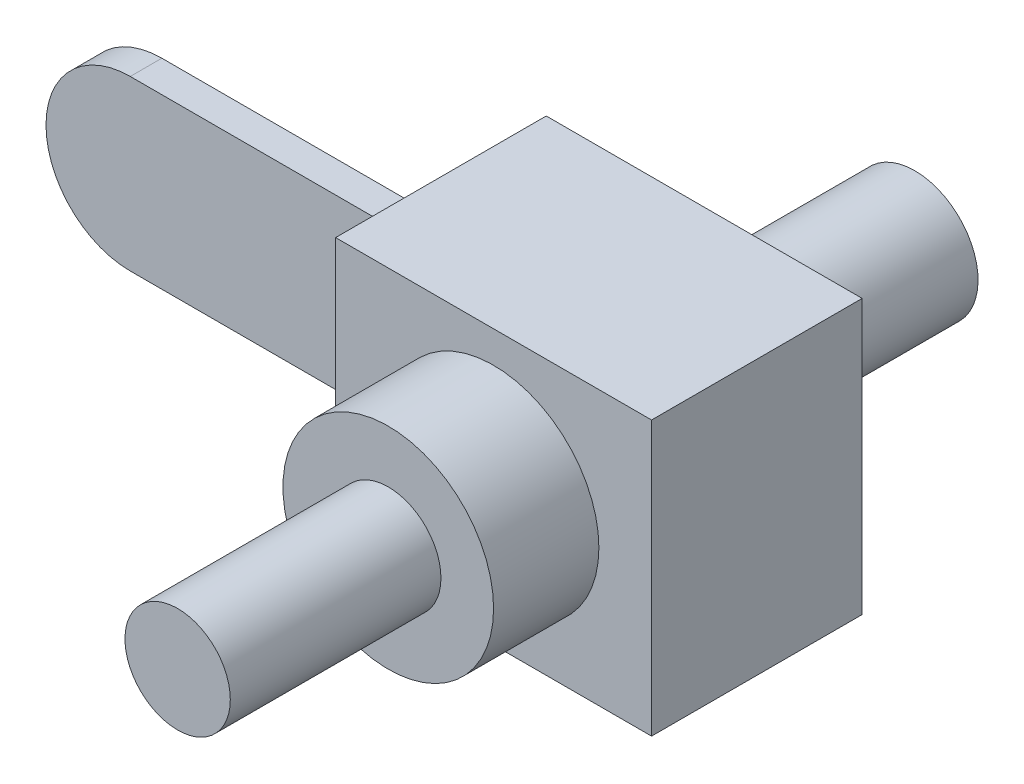
ISO-10303-21;
HEADER;
FILE_DESCRIPTION(('STEP AP214'),'2;1');
FILE_NAME('part.step','',(''),(''),'','','');
FILE_SCHEMA(('AUTOMOTIVE_DESIGN { 1 0 10303 214 1 1 1 1 }'));
ENDSEC;
DATA;
#1=APPLICATION_CONTEXT('core data for automotive mechanical design processes');
#2=APPLICATION_PROTOCOL_DEFINITION('international standard','automotive_design',2000,#1);
#3=PRODUCT_CONTEXT('',#1,'mechanical');
#4=PRODUCT('Part','Part','',(#3));
#5=PRODUCT_RELATED_PRODUCT_CATEGORY('part','',(#4));
#6=PRODUCT_DEFINITION_FORMATION('','',#4);
#7=PRODUCT_DEFINITION_CONTEXT('part definition',#1,'design');
#8=PRODUCT_DEFINITION('design','',#6,#7);
#9=PRODUCT_DEFINITION_SHAPE('','',#8);
#10=(LENGTH_UNIT() NAMED_UNIT(*) SI_UNIT(.MILLI.,.METRE.));
#11=(NAMED_UNIT(*) PLANE_ANGLE_UNIT() SI_UNIT($,.RADIAN.));
#12=(NAMED_UNIT(*) SI_UNIT($,.STERADIAN.) SOLID_ANGLE_UNIT());
#13=UNCERTAINTY_MEASURE_WITH_UNIT(LENGTH_MEASURE(1.E-05),#10,'distance_accuracy_value','');
#14=(GEOMETRIC_REPRESENTATION_CONTEXT(3) GLOBAL_UNCERTAINTY_ASSIGNED_CONTEXT((#13)) GLOBAL_UNIT_ASSIGNED_CONTEXT((#10,
#11,#12)) REPRESENTATION_CONTEXT('',''));
#15=CARTESIAN_POINT('',(0.,0.,0.));
#16=DIRECTION('',(0.,0.,1.));
#17=DIRECTION('',(1.,0.,0.));
#18=AXIS2_PLACEMENT_3D('',#15,#16,#17);
#19=CARTESIAN_POINT('',(0.,0.,7.5));
#20=DIRECTION('',(0.,0.,-1.));
#21=DIRECTION('',(-1.,0.,0.));
#22=AXIS2_PLACEMENT_3D('',#19,#20,#21);
#23=CYLINDRICAL_SURFACE('',#22,40.);
#24=CARTESIAN_POINT('',(0.,0.,-7.5));
#25=DIRECTION('',(0.,0.,1.));
#26=DIRECTION('',(1.,0.,0.));
#27=AXIS2_PLACEMENT_3D('',#24,#25,#26);
#28=CIRCLE('',#27,40.);
#29=CARTESIAN_POINT('',(0.,40.,-7.5));
#30=VERTEX_POINT('',#29);
#31=CARTESIAN_POINT('',(0.,-40.,-7.5));
#32=VERTEX_POINT('',#31);
#33=EDGE_CURVE('E141',#30,#32,#28,.T.);
#34=ORIENTED_EDGE('',*,*,#33,.T.);
#35=DIRECTION('',(0.,0.,-1.));
#36=VECTOR('',#35,1.);
#37=CARTESIAN_POINT('',(0.,-40.,7.5));
#38=LINE('',#37,#36);
#39=CARTESIAN_POINT('',(0.,-40.,7.5));
#40=VERTEX_POINT('',#39);
#41=EDGE_CURVE('E42',#40,#32,#38,.T.);
#42=ORIENTED_EDGE('',*,*,#41,.F.);
#43=CARTESIAN_POINT('',(0.,0.,7.5));
#44=DIRECTION('',(0.,0.,1.));
#45=DIRECTION('',(1.,0.,0.));
#46=AXIS2_PLACEMENT_3D('',#43,#44,#45);
#47=CIRCLE('',#46,40.);
#48=CARTESIAN_POINT('',(0.,40.,7.5));
#49=VERTEX_POINT('',#48);
#50=EDGE_CURVE('E152',#49,#40,#47,.T.);
#51=ORIENTED_EDGE('',*,*,#50,.F.);
#52=DIRECTION('',(0.,0.,-1.));
#53=VECTOR('',#52,1.);
#54=CARTESIAN_POINT('',(0.,40.,7.5));
#55=LINE('',#54,#53);
#56=EDGE_CURVE('E161',#49,#30,#55,.T.);
#57=ORIENTED_EDGE('',*,*,#56,.T.);
#58=EDGE_LOOP('',(#34,#42,#51,#57));
#59=FACE_BOUND('',#58,.T.);
#60=ADVANCED_FACE('F39',(#59),#23,.T.);
#61=CARTESIAN_POINT('',(140.,-40.,7.5));
#62=DIRECTION('',(0.,1.,0.));
#63=DIRECTION('',(-1.,0.,0.));
#64=AXIS2_PLACEMENT_3D('',#61,#62,#63);
#65=PLANE('',#64);
#66=DIRECTION('',(1.,0.,0.));
#67=VECTOR('',#66,1.);
#68=CARTESIAN_POINT('',(140.,-40.,-7.5));
#69=LINE('',#68,#67);
#70=CARTESIAN_POINT('',(140.,-40.,-7.5));
#71=VERTEX_POINT('',#70);
#72=EDGE_CURVE('E146',#32,#71,#69,.T.);
#73=ORIENTED_EDGE('',*,*,#72,.T.);
#74=DIRECTION('',(0.,0.,-1.));
#75=VECTOR('',#74,1.);
#76=CARTESIAN_POINT('',(140.,-40.,7.5));
#77=LINE('',#76,#75);
#78=CARTESIAN_POINT('',(140.,-40.,7.5));
#79=VERTEX_POINT('',#78);
#80=EDGE_CURVE('E175',#79,#71,#77,.T.);
#81=ORIENTED_EDGE('',*,*,#80,.F.);
#82=DIRECTION('',(1.,0.,0.));
#83=VECTOR('',#82,1.);
#84=CARTESIAN_POINT('',(140.,-40.,7.5));
#85=LINE('',#84,#83);
#86=EDGE_CURVE('E83',#40,#79,#85,.T.);
#87=ORIENTED_EDGE('',*,*,#86,.F.);
#88=ORIENTED_EDGE('',*,*,#41,.T.);
#89=EDGE_LOOP('',(#73,#81,#87,#88));
#90=FACE_BOUND('',#89,.T.);
#91=ADVANCED_FACE('F234',(#90),#65,.F.);
#92=CARTESIAN_POINT('',(0.,40.,7.5));
#93=DIRECTION('',(0.,-1.,0.));
#94=DIRECTION('',(1.,0.,0.));
#95=AXIS2_PLACEMENT_3D('',#92,#93,#94);
#96=PLANE('',#95);
#97=DIRECTION('',(-1.,0.,0.));
#98=VECTOR('',#97,1.);
#99=CARTESIAN_POINT('',(0.,40.,-7.5));
#100=LINE('',#99,#98);
#101=CARTESIAN_POINT('',(140.,40.,-7.5));
#102=VERTEX_POINT('',#101);
#103=EDGE_CURVE('E75',#102,#30,#100,.T.);
#104=ORIENTED_EDGE('',*,*,#103,.T.);
#105=ORIENTED_EDGE('',*,*,#56,.F.);
#106=DIRECTION('',(-1.,0.,0.));
#107=VECTOR('',#106,1.);
#108=CARTESIAN_POINT('',(0.,40.,7.5));
#109=LINE('',#108,#107);
#110=CARTESIAN_POINT('',(140.,40.,7.5));
#111=VERTEX_POINT('',#110);
#112=EDGE_CURVE('E58',#111,#49,#109,.T.);
#113=ORIENTED_EDGE('',*,*,#112,.F.);
#114=DIRECTION('',(0.,0.,-1.));
#115=VECTOR('',#114,1.);
#116=CARTESIAN_POINT('',(140.,40.,7.5));
#117=LINE('',#116,#115);
#118=EDGE_CURVE('E72',#111,#102,#117,.T.);
#119=ORIENTED_EDGE('',*,*,#118,.T.);
#120=EDGE_LOOP('',(#104,#105,#113,#119));
#121=FACE_BOUND('',#120,.T.);
#122=ADVANCED_FACE('F239',(#121),#96,.F.);
#123=CARTESIAN_POINT('',(0.,0.,7.5));
#124=DIRECTION('',(0.,0.,1.));
#125=DIRECTION('',(1.,0.,0.));
#126=AXIS2_PLACEMENT_3D('',#123,#124,#125);
#127=PLANE('',#126);
#128=ORIENTED_EDGE('',*,*,#50,.T.);
#129=ORIENTED_EDGE('',*,*,#86,.T.);
#130=DIRECTION('',(0.,1.,0.));
#131=VECTOR('',#130,1.);
#132=CARTESIAN_POINT('',(140.,40.,7.5));
#133=LINE('',#132,#131);
#134=EDGE_CURVE('E157',#79,#111,#133,.T.);
#135=ORIENTED_EDGE('',*,*,#134,.T.);
#136=ORIENTED_EDGE('',*,*,#112,.T.);
#137=EDGE_LOOP('',(#128,#129,#135,#136));
#138=FACE_BOUND('',#137,.T.);
#139=ADVANCED_FACE('F244',(#138),#127,.T.);
#140=CARTESIAN_POINT('',(0.,0.,-7.5));
#141=DIRECTION('',(0.,0.,1.));
#142=DIRECTION('',(1.,0.,0.));
#143=AXIS2_PLACEMENT_3D('',#140,#141,#142);
#144=PLANE('',#143);
#145=ORIENTED_EDGE('',*,*,#33,.F.);
#146=ORIENTED_EDGE('',*,*,#103,.F.);
#147=DIRECTION('',(0.,1.,0.));
#148=VECTOR('',#147,1.);
#149=CARTESIAN_POINT('',(140.,40.,-7.5));
#150=LINE('',#149,#148);
#151=EDGE_CURVE('E166',#71,#102,#150,.T.);
#152=ORIENTED_EDGE('',*,*,#151,.F.);
#153=ORIENTED_EDGE('',*,*,#72,.F.);
#154=EDGE_LOOP('',(#145,#146,#152,#153));
#155=FACE_BOUND('',#154,.T.);
#156=ADVANCED_FACE('F243',(#155),#144,.F.);
#157=CARTESIAN_POINT('',(140.,0.,0.));
#158=DIRECTION('',(1.,0.,0.));
#159=DIRECTION('',(0.,0.,-1.));
#160=AXIS2_PLACEMENT_3D('',#157,#158,#159);
#161=PLANE('',#160);
#162=DIRECTION('',(0.,1.,0.));
#163=VECTOR('',#162,1.);
#164=CARTESIAN_POINT('',(140.,65.,-50.));
#165=LINE('',#164,#163);
#166=CARTESIAN_POINT('',(140.,-65.,-50.));
#167=VERTEX_POINT('',#166);
#168=CARTESIAN_POINT('',(140.,65.,-50.));
#169=VERTEX_POINT('',#168);
#170=EDGE_CURVE('E139',#167,#169,#165,.T.);
#171=ORIENTED_EDGE('',*,*,#170,.F.);
#172=DIRECTION('',(0.,0.,-1.));
#173=VECTOR('',#172,1.);
#174=CARTESIAN_POINT('',(140.,-65.,50.));
#175=LINE('',#174,#173);
#176=CARTESIAN_POINT('',(140.,-65.,50.));
#177=VERTEX_POINT('',#176);
#178=EDGE_CURVE('E135',#177,#167,#175,.T.);
#179=ORIENTED_EDGE('',*,*,#178,.F.);
#180=DIRECTION('',(0.,-1.,0.));
#181=VECTOR('',#180,1.);
#182=CARTESIAN_POINT('',(140.,65.,50.));
#183=LINE('',#182,#181);
#184=CARTESIAN_POINT('',(140.,65.,50.));
#185=VERTEX_POINT('',#184);
#186=EDGE_CURVE('E204',#185,#177,#183,.T.);
#187=ORIENTED_EDGE('',*,*,#186,.F.);
#188=DIRECTION('',(0.,0.,1.));
#189=VECTOR('',#188,1.);
#190=CARTESIAN_POINT('',(140.,65.,50.));
#191=LINE('',#190,#189);
#192=EDGE_CURVE('E201',#169,#185,#191,.T.);
#193=ORIENTED_EDGE('',*,*,#192,.F.);
#194=EDGE_LOOP('',(#171,#179,#187,#193));
#195=FACE_BOUND('',#194,.T.);
#196=ORIENTED_EDGE('',*,*,#80,.T.);
#197=ORIENTED_EDGE('',*,*,#151,.T.);
#198=ORIENTED_EDGE('',*,*,#118,.F.);
#199=ORIENTED_EDGE('',*,*,#134,.F.);
#200=EDGE_LOOP('',(#196,#197,#198,#199));
#201=FACE_BOUND('',#200,.T.);
#202=ADVANCED_FACE('F219',(#195,#201),#161,.F.);
#203=CARTESIAN_POINT('',(290.,65.,-50.));
#204=DIRECTION('',(0.,0.,1.));
#205=DIRECTION('',(0.,-1.,0.));
#206=AXIS2_PLACEMENT_3D('',#203,#204,#205);
#207=PLANE('',#206);
#208=CARTESIAN_POINT('',(215.,0.,-50.));
#209=DIRECTION('',(0.,0.,-1.));
#210=DIRECTION('',(0.,1.,0.));
#211=AXIS2_PLACEMENT_3D('',#208,#209,#210);
#212=CIRCLE('',#211,30.);
#213=CARTESIAN_POINT('',(215.,30.,-50.));
#214=VERTEX_POINT('',#213);
#215=EDGE_CURVE('E181',#214,#214,#212,.T.);
#216=ORIENTED_EDGE('',*,*,#215,.F.);
#217=EDGE_LOOP('',(#216));
#218=FACE_BOUND('',#217,.T.);
#219=ORIENTED_EDGE('',*,*,#170,.T.);
#220=DIRECTION('',(-1.,0.,0.));
#221=VECTOR('',#220,1.);
#222=CARTESIAN_POINT('',(290.,65.,-50.));
#223=LINE('',#222,#221);
#224=CARTESIAN_POINT('',(290.,65.,-50.));
#225=VERTEX_POINT('',#224);
#226=EDGE_CURVE('E117',#225,#169,#223,.T.);
#227=ORIENTED_EDGE('',*,*,#226,.F.);
#228=DIRECTION('',(0.,1.,0.));
#229=VECTOR('',#228,1.);
#230=CARTESIAN_POINT('',(290.,65.,-50.));
#231=LINE('',#230,#229);
#232=CARTESIAN_POINT('',(290.,-65.,-50.));
#233=VERTEX_POINT('',#232);
#234=EDGE_CURVE('E125',#233,#225,#231,.T.);
#235=ORIENTED_EDGE('',*,*,#234,.F.);
#236=DIRECTION('',(-1.,0.,0.));
#237=VECTOR('',#236,1.);
#238=CARTESIAN_POINT('',(290.,-65.,-50.));
#239=LINE('',#238,#237);
#240=EDGE_CURVE('E198',#233,#167,#239,.T.);
#241=ORIENTED_EDGE('',*,*,#240,.T.);
#242=EDGE_LOOP('',(#219,#227,#235,#241));
#243=FACE_BOUND('',#242,.T.);
#244=ADVANCED_FACE('F137',(#218,#243),#207,.F.);
#245=CARTESIAN_POINT('',(290.,65.,50.));
#246=DIRECTION('',(0.,-1.,0.));
#247=DIRECTION('',(0.,0.,-1.));
#248=AXIS2_PLACEMENT_3D('',#245,#246,#247);
#249=PLANE('',#248);
#250=ORIENTED_EDGE('',*,*,#192,.T.);
#251=DIRECTION('',(-1.,0.,0.));
#252=VECTOR('',#251,1.);
#253=CARTESIAN_POINT('',(290.,65.,50.));
#254=LINE('',#253,#252);
#255=CARTESIAN_POINT('',(290.,65.,50.));
#256=VERTEX_POINT('',#255);
#257=EDGE_CURVE('E120',#256,#185,#254,.T.);
#258=ORIENTED_EDGE('',*,*,#257,.F.);
#259=DIRECTION('',(0.,0.,1.));
#260=VECTOR('',#259,1.);
#261=CARTESIAN_POINT('',(290.,65.,50.));
#262=LINE('',#261,#260);
#263=EDGE_CURVE('E113',#225,#256,#262,.T.);
#264=ORIENTED_EDGE('',*,*,#263,.F.);
#265=ORIENTED_EDGE('',*,*,#226,.T.);
#266=EDGE_LOOP('',(#250,#258,#264,#265));
#267=FACE_BOUND('',#266,.T.);
#268=ADVANCED_FACE('F115',(#267),#249,.F.);
#269=CARTESIAN_POINT('',(290.,65.,50.));
#270=DIRECTION('',(0.,0.,-1.));
#271=DIRECTION('',(0.,1.,0.));
#272=AXIS2_PLACEMENT_3D('',#269,#270,#271);
#273=PLANE('',#272);
#274=CARTESIAN_POINT('',(215.,0.,50.));
#275=DIRECTION('',(0.,0.,1.));
#276=DIRECTION('',(1.,0.,0.));
#277=AXIS2_PLACEMENT_3D('',#274,#275,#276);
#278=CIRCLE('',#277,50.);
#279=CARTESIAN_POINT('',(265.,0.,50.));
#280=VERTEX_POINT('',#279);
#281=EDGE_CURVE('E49',#280,#280,#278,.T.);
#282=ORIENTED_EDGE('',*,*,#281,.F.);
#283=EDGE_LOOP('',(#282));
#284=FACE_BOUND('',#283,.T.);
#285=ORIENTED_EDGE('',*,*,#186,.T.);
#286=DIRECTION('',(-1.,0.,0.));
#287=VECTOR('',#286,1.);
#288=CARTESIAN_POINT('',(290.,-65.,50.));
#289=LINE('',#288,#287);
#290=CARTESIAN_POINT('',(290.,-65.,50.));
#291=VERTEX_POINT('',#290);
#292=EDGE_CURVE('E148',#291,#177,#289,.T.);
#293=ORIENTED_EDGE('',*,*,#292,.F.);
#294=DIRECTION('',(0.,-1.,0.));
#295=VECTOR('',#294,1.);
#296=CARTESIAN_POINT('',(290.,65.,50.));
#297=LINE('',#296,#295);
#298=EDGE_CURVE('E124',#256,#291,#297,.T.);
#299=ORIENTED_EDGE('',*,*,#298,.F.);
#300=ORIENTED_EDGE('',*,*,#257,.T.);
#301=EDGE_LOOP('',(#285,#293,#299,#300));
#302=FACE_BOUND('',#301,.T.);
#303=ADVANCED_FACE('F220',(#284,#302),#273,.F.);
#304=CARTESIAN_POINT('',(290.,-65.,50.));
#305=DIRECTION('',(0.,1.,0.));
#306=DIRECTION('',(0.,0.,1.));
#307=AXIS2_PLACEMENT_3D('',#304,#305,#306);
#308=PLANE('',#307);
#309=ORIENTED_EDGE('',*,*,#178,.T.);
#310=ORIENTED_EDGE('',*,*,#240,.F.);
#311=DIRECTION('',(0.,0.,-1.));
#312=VECTOR('',#311,1.);
#313=CARTESIAN_POINT('',(290.,-65.,50.));
#314=LINE('',#313,#312);
#315=EDGE_CURVE('E130',#291,#233,#314,.T.);
#316=ORIENTED_EDGE('',*,*,#315,.F.);
#317=ORIENTED_EDGE('',*,*,#292,.T.);
#318=EDGE_LOOP('',(#309,#310,#316,#317));
#319=FACE_BOUND('',#318,.T.);
#320=ADVANCED_FACE('F215',(#319),#308,.F.);
#321=CARTESIAN_POINT('',(290.,0.,0.));
#322=DIRECTION('',(1.,0.,0.));
#323=DIRECTION('',(0.,0.,-1.));
#324=AXIS2_PLACEMENT_3D('',#321,#322,#323);
#325=PLANE('',#324);
#326=ORIENTED_EDGE('',*,*,#234,.T.);
#327=ORIENTED_EDGE('',*,*,#263,.T.);
#328=ORIENTED_EDGE('',*,*,#298,.T.);
#329=ORIENTED_EDGE('',*,*,#315,.T.);
#330=EDGE_LOOP('',(#326,#327,#328,#329));
#331=FACE_BOUND('',#330,.T.);
#332=ADVANCED_FACE('F128',(#331),#325,.T.);
#333=CARTESIAN_POINT('',(215.,0.,-150.));
#334=DIRECTION('',(0.,0.,1.));
#335=DIRECTION('',(0.,-1.,0.));
#336=AXIS2_PLACEMENT_3D('',#333,#334,#335);
#337=CYLINDRICAL_SURFACE('',#336,30.);
#338=CARTESIAN_POINT('',(215.,0.,-150.));
#339=DIRECTION('',(0.,0.,-1.));
#340=DIRECTION('',(0.,1.,0.));
#341=AXIS2_PLACEMENT_3D('',#338,#339,#340);
#342=CIRCLE('',#341,30.);
#343=CARTESIAN_POINT('',(215.,30.,-150.));
#344=VERTEX_POINT('',#343);
#345=EDGE_CURVE('E192',#344,#344,#342,.T.);
#346=ORIENTED_EDGE('',*,*,#345,.F.);
#347=EDGE_LOOP('',(#346));
#348=FACE_BOUND('',#347,.T.);
#349=ORIENTED_EDGE('',*,*,#215,.T.);
#350=EDGE_LOOP('',(#349));
#351=FACE_BOUND('',#350,.T.);
#352=ADVANCED_FACE('F267',(#348,#351),#337,.T.);
#353=CARTESIAN_POINT('',(215.,0.,-150.));
#354=DIRECTION('',(0.,0.,-1.));
#355=DIRECTION('',(0.,1.,0.));
#356=AXIS2_PLACEMENT_3D('',#353,#354,#355);
#357=PLANE('',#356);
#358=ORIENTED_EDGE('',*,*,#345,.T.);
#359=EDGE_LOOP('',(#358));
#360=FACE_BOUND('',#359,.T.);
#361=ADVANCED_FACE('F270',(#360),#357,.T.);
#362=CARTESIAN_POINT('',(215.,0.,100.));
#363=DIRECTION('',(0.,0.,-1.));
#364=DIRECTION('',(-1.,0.,0.));
#365=AXIS2_PLACEMENT_3D('',#362,#363,#364);
#366=CYLINDRICAL_SURFACE('',#365,50.);
#367=CARTESIAN_POINT('',(215.,0.,100.));
#368=DIRECTION('',(0.,0.,1.));
#369=DIRECTION('',(1.,0.,0.));
#370=AXIS2_PLACEMENT_3D('',#367,#368,#369);
#371=CIRCLE('',#370,50.);
#372=CARTESIAN_POINT('',(265.,0.,100.));
#373=VERTEX_POINT('',#372);
#374=EDGE_CURVE('E296',#373,#373,#371,.T.);
#375=ORIENTED_EDGE('',*,*,#374,.F.);
#376=EDGE_LOOP('',(#375));
#377=FACE_BOUND('',#376,.T.);
#378=ORIENTED_EDGE('',*,*,#281,.T.);
#379=EDGE_LOOP('',(#378));
#380=FACE_BOUND('',#379,.T.);
#381=ADVANCED_FACE('F274',(#377,#380),#366,.T.);
#382=CARTESIAN_POINT('',(215.,0.,100.));
#383=DIRECTION('',(0.,0.,1.));
#384=DIRECTION('',(1.,0.,0.));
#385=AXIS2_PLACEMENT_3D('',#382,#383,#384);
#386=PLANE('',#385);
#387=CARTESIAN_POINT('',(215.,0.,100.));
#388=DIRECTION('',(0.,0.,1.));
#389=DIRECTION('',(1.,0.,0.));
#390=AXIS2_PLACEMENT_3D('',#387,#388,#389);
#391=CIRCLE('',#390,25.);
#392=CARTESIAN_POINT('',(240.,0.,100.));
#393=VERTEX_POINT('',#392);
#394=EDGE_CURVE('E11',#393,#393,#391,.T.);
#395=ORIENTED_EDGE('',*,*,#394,.F.);
#396=EDGE_LOOP('',(#395));
#397=FACE_BOUND('',#396,.T.);
#398=ORIENTED_EDGE('',*,*,#374,.T.);
#399=EDGE_LOOP('',(#398));
#400=FACE_BOUND('',#399,.T.);
#401=ADVANCED_FACE('F278',(#397,#400),#386,.T.);
#402=CARTESIAN_POINT('',(215.,0.,200.));
#403=DIRECTION('',(0.,0.,-1.));
#404=DIRECTION('',(-1.,0.,0.));
#405=AXIS2_PLACEMENT_3D('',#402,#403,#404);
#406=CYLINDRICAL_SURFACE('',#405,25.);
#407=CARTESIAN_POINT('',(215.,0.,200.));
#408=DIRECTION('',(0.,0.,1.));
#409=DIRECTION('',(1.,0.,0.));
#410=AXIS2_PLACEMENT_3D('',#407,#408,#409);
#411=CIRCLE('',#410,25.);
#412=CARTESIAN_POINT('',(240.,0.,200.));
#413=VERTEX_POINT('',#412);
#414=EDGE_CURVE('E294',#413,#413,#411,.T.);
#415=ORIENTED_EDGE('',*,*,#414,.F.);
#416=EDGE_LOOP('',(#415));
#417=FACE_BOUND('',#416,.T.);
#418=ORIENTED_EDGE('',*,*,#394,.T.);
#419=EDGE_LOOP('',(#418));
#420=FACE_BOUND('',#419,.T.);
#421=ADVANCED_FACE('F282',(#417,#420),#406,.T.);
#422=CARTESIAN_POINT('',(215.,0.,200.));
#423=DIRECTION('',(0.,0.,1.));
#424=DIRECTION('',(1.,0.,0.));
#425=AXIS2_PLACEMENT_3D('',#422,#423,#424);
#426=PLANE('',#425);
#427=ORIENTED_EDGE('',*,*,#414,.T.);
#428=EDGE_LOOP('',(#427));
#429=FACE_BOUND('',#428,.T.);
#430=ADVANCED_FACE('F286',(#429),#426,.T.);
#431=CLOSED_SHELL('',(#60,#91,#122,#139,#156,#202,#244,#268,#303,#320,#332,#352,#361,#381,#401,
#421,#430));
#432=MANIFOLD_SOLID_BREP('B2',#431);
#433=ADVANCED_BREP_SHAPE_REPRESENTATION('',(#18,#432),#14);
#434=SHAPE_DEFINITION_REPRESENTATION(#9,#433);
ENDSEC;
END-ISO-10303-21;
